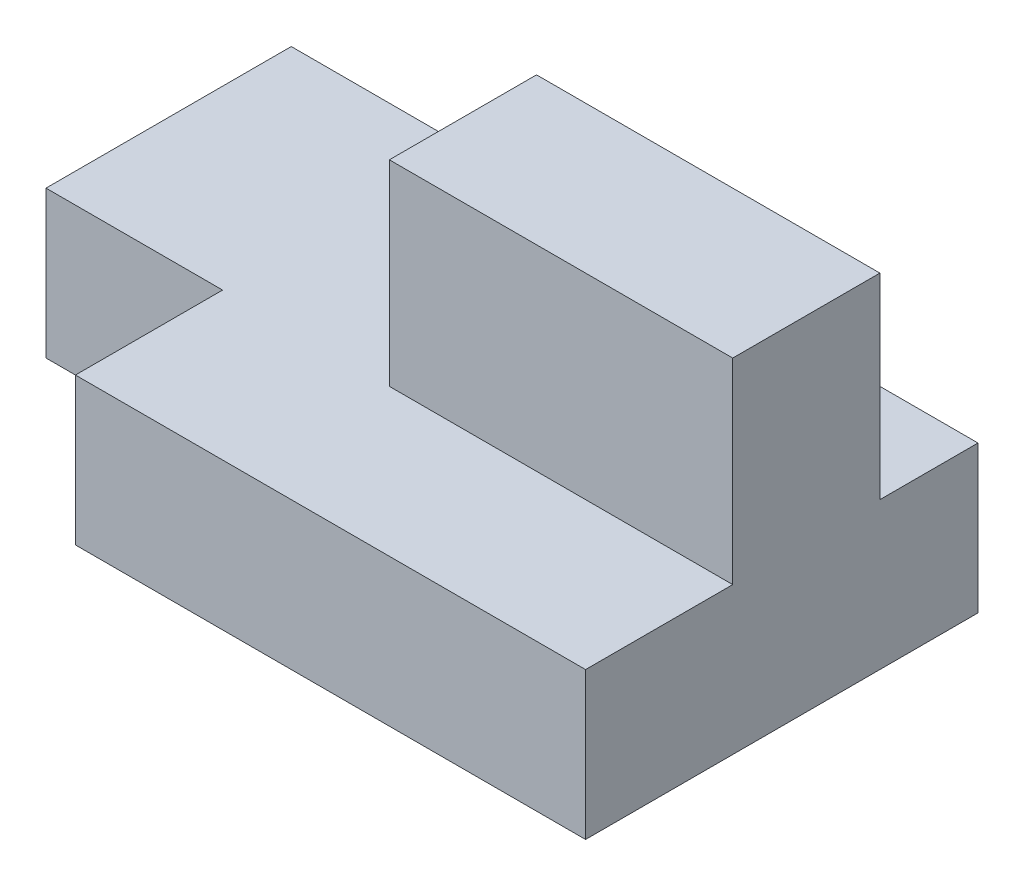
ISO-10303-21;
HEADER;
FILE_DESCRIPTION(('STEP AP214'),'2;1');
FILE_NAME('part.step','',(''),(''),'','','');
FILE_SCHEMA(('AUTOMOTIVE_DESIGN { 1 0 10303 214 1 1 1 1 }'));
ENDSEC;
DATA;
#1=APPLICATION_CONTEXT('core data for automotive mechanical design processes');
#2=APPLICATION_PROTOCOL_DEFINITION('international standard','automotive_design',2000,#1);
#3=PRODUCT_CONTEXT('',#1,'mechanical');
#4=PRODUCT('Part','Part','',(#3));
#5=PRODUCT_RELATED_PRODUCT_CATEGORY('part','',(#4));
#6=PRODUCT_DEFINITION_FORMATION('','',#4);
#7=PRODUCT_DEFINITION_CONTEXT('part definition',#1,'design');
#8=PRODUCT_DEFINITION('design','',#6,#7);
#9=PRODUCT_DEFINITION_SHAPE('','',#8);
#10=(LENGTH_UNIT() NAMED_UNIT(*) SI_UNIT(.MILLI.,.METRE.));
#11=(NAMED_UNIT(*) PLANE_ANGLE_UNIT() SI_UNIT($,.RADIAN.));
#12=(NAMED_UNIT(*) SI_UNIT($,.STERADIAN.) SOLID_ANGLE_UNIT());
#13=UNCERTAINTY_MEASURE_WITH_UNIT(LENGTH_MEASURE(1.E-05),#10,'distance_accuracy_value','');
#14=(GEOMETRIC_REPRESENTATION_CONTEXT(3) GLOBAL_UNCERTAINTY_ASSIGNED_CONTEXT((#13)) GLOBAL_UNIT_ASSIGNED_CONTEXT((#10,
#11,#12)) REPRESENTATION_CONTEXT('',''));
#15=CARTESIAN_POINT('',(0.,0.,0.));
#16=DIRECTION('',(0.,0.,1.));
#17=DIRECTION('',(1.,0.,0.));
#18=AXIS2_PLACEMENT_3D('',#15,#16,#17);
#19=CARTESIAN_POINT('',(0.,15.,0.));
#20=DIRECTION('',(0.,-1.,0.));
#21=DIRECTION('',(0.,0.,-1.));
#22=AXIS2_PLACEMENT_3D('',#19,#20,#21);
#23=PLANE('',#22);
#24=DIRECTION('',(1.,0.,0.));
#25=VECTOR('',#24,1.);
#26=CARTESIAN_POINT('',(0.,15.,25.));
#27=LINE('',#26,#25);
#28=CARTESIAN_POINT('',(-35.,15.,25.));
#29=VERTEX_POINT('',#28);
#30=CARTESIAN_POINT('',(0.,15.,25.));
#31=VERTEX_POINT('',#30);
#32=EDGE_CURVE('E48',#29,#31,#27,.T.);
#33=ORIENTED_EDGE('',*,*,#32,.F.);
#34=DIRECTION('',(0.,0.,1.));
#35=VECTOR('',#34,1.);
#36=CARTESIAN_POINT('',(-35.,15.,9.99999999999999));
#37=LINE('',#36,#35);
#38=CARTESIAN_POINT('',(-35.,15.,9.99999999999999));
#39=VERTEX_POINT('',#38);
#40=EDGE_CURVE('E206',#39,#29,#37,.T.);
#41=ORIENTED_EDGE('',*,*,#40,.F.);
#42=DIRECTION('',(-1.,0.,0.));
#43=VECTOR('',#42,1.);
#44=CARTESIAN_POINT('',(0.,15.,10.));
#45=LINE('',#44,#43);
#46=CARTESIAN_POINT('',(0.,15.,10.));
#47=VERTEX_POINT('',#46);
#48=EDGE_CURVE('E54',#47,#39,#45,.T.);
#49=ORIENTED_EDGE('',*,*,#48,.F.);
#50=DIRECTION('',(0.,0.,-1.));
#51=VECTOR('',#50,1.);
#52=CARTESIAN_POINT('',(0.,15.,0.));
#53=LINE('',#52,#51);
#54=CARTESIAN_POINT('',(0.,15.,0.));
#55=VERTEX_POINT('',#54);
#56=EDGE_CURVE('E131',#47,#55,#53,.T.);
#57=ORIENTED_EDGE('',*,*,#56,.T.);
#58=DIRECTION('',(-1.,0.,0.));
#59=VECTOR('',#58,1.);
#60=CARTESIAN_POINT('',(0.,15.,0.));
#61=LINE('',#60,#59);
#62=CARTESIAN_POINT('',(-70.,15.,0.));
#63=VERTEX_POINT('',#62);
#64=EDGE_CURVE('E142',#55,#63,#61,.T.);
#65=ORIENTED_EDGE('',*,*,#64,.T.);
#66=DIRECTION('',(0.,0.,1.));
#67=VECTOR('',#66,1.);
#68=CARTESIAN_POINT('',(-70.,15.,0.));
#69=LINE('',#68,#67);
#70=CARTESIAN_POINT('',(-70.,15.,25.));
#71=VERTEX_POINT('',#70);
#72=EDGE_CURVE('E144',#63,#71,#69,.T.);
#73=ORIENTED_EDGE('',*,*,#72,.T.);
#74=DIRECTION('',(1.,0.,0.));
#75=VECTOR('',#74,1.);
#76=CARTESIAN_POINT('',(-70.,15.,25.));
#77=LINE('',#76,#75);
#78=CARTESIAN_POINT('',(-52.,15.,25.));
#79=VERTEX_POINT('',#78);
#80=EDGE_CURVE('E146',#71,#79,#77,.T.);
#81=ORIENTED_EDGE('',*,*,#80,.T.);
#82=DIRECTION('',(0.,0.,1.));
#83=VECTOR('',#82,1.);
#84=CARTESIAN_POINT('',(-52.,15.,40.));
#85=LINE('',#84,#83);
#86=CARTESIAN_POINT('',(-52.,15.,40.));
#87=VERTEX_POINT('',#86);
#88=EDGE_CURVE('E148',#79,#87,#85,.T.);
#89=ORIENTED_EDGE('',*,*,#88,.T.);
#90=DIRECTION('',(1.,0.,0.));
#91=VECTOR('',#90,1.);
#92=CARTESIAN_POINT('',(0.,15.,40.));
#93=LINE('',#92,#91);
#94=CARTESIAN_POINT('',(0.,15.,40.));
#95=VERTEX_POINT('',#94);
#96=EDGE_CURVE('E150',#87,#95,#93,.T.);
#97=ORIENTED_EDGE('',*,*,#96,.T.);
#98=EDGE_CURVE('E140',#95,#31,#53,.T.);
#99=ORIENTED_EDGE('',*,*,#98,.T.);
#100=EDGE_LOOP('',(#33,#41,#49,#57,#65,#73,#81,#89,#97,#99));
#101=FACE_BOUND('',#100,.T.);
#102=ADVANCED_FACE('F33',(#101),#23,.F.);
#103=CARTESIAN_POINT('',(0.,15.,0.));
#104=DIRECTION('',(-1.,0.,0.));
#105=DIRECTION('',(0.,0.,1.));
#106=AXIS2_PLACEMENT_3D('',#103,#104,#105);
#107=PLANE('',#106);
#108=DIRECTION('',(0.,0.,-1.));
#109=VECTOR('',#108,1.);
#110=CARTESIAN_POINT('',(0.,0.,0.));
#111=LINE('',#110,#109);
#112=CARTESIAN_POINT('',(0.,0.,40.));
#113=VERTEX_POINT('',#112);
#114=CARTESIAN_POINT('',(0.,0.,0.));
#115=VERTEX_POINT('',#114);
#116=EDGE_CURVE('E132',#113,#115,#111,.T.);
#117=ORIENTED_EDGE('',*,*,#116,.T.);
#118=DIRECTION('',(0.,-1.,0.));
#119=VECTOR('',#118,1.);
#120=CARTESIAN_POINT('',(0.,15.,0.));
#121=LINE('',#120,#119);
#122=EDGE_CURVE('E11',#55,#115,#121,.T.);
#123=ORIENTED_EDGE('',*,*,#122,.F.);
#124=ORIENTED_EDGE('',*,*,#56,.F.);
#125=DIRECTION('',(0.,-1.,0.));
#126=VECTOR('',#125,1.);
#127=CARTESIAN_POINT('',(0.,35.,10.));
#128=LINE('',#127,#126);
#129=CARTESIAN_POINT('',(0.,35.,10.));
#130=VERTEX_POINT('',#129);
#131=EDGE_CURVE('E113',#130,#47,#128,.T.);
#132=ORIENTED_EDGE('',*,*,#131,.F.);
#133=DIRECTION('',(0.,0.,-1.));
#134=VECTOR('',#133,1.);
#135=CARTESIAN_POINT('',(0.,35.,10.));
#136=LINE('',#135,#134);
#137=CARTESIAN_POINT('',(0.,35.,25.));
#138=VERTEX_POINT('',#137);
#139=EDGE_CURVE('E119',#138,#130,#136,.T.);
#140=ORIENTED_EDGE('',*,*,#139,.F.);
#141=DIRECTION('',(0.,-1.,0.));
#142=VECTOR('',#141,1.);
#143=CARTESIAN_POINT('',(0.,35.,25.));
#144=LINE('',#143,#142);
#145=EDGE_CURVE('E201',#138,#31,#144,.T.);
#146=ORIENTED_EDGE('',*,*,#145,.T.);
#147=ORIENTED_EDGE('',*,*,#98,.F.);
#148=DIRECTION('',(0.,-1.,0.));
#149=VECTOR('',#148,1.);
#150=CARTESIAN_POINT('',(0.,15.,40.));
#151=LINE('',#150,#149);
#152=EDGE_CURVE('E151',#95,#113,#151,.T.);
#153=ORIENTED_EDGE('',*,*,#152,.T.);
#154=EDGE_LOOP('',(#117,#123,#124,#132,#140,#146,#147,#153));
#155=FACE_BOUND('',#154,.T.);
#156=ADVANCED_FACE('F35',(#155),#107,.F.);
#157=CARTESIAN_POINT('',(0.,15.,0.));
#158=DIRECTION('',(0.,0.,1.));
#159=DIRECTION('',(1.,0.,0.));
#160=AXIS2_PLACEMENT_3D('',#157,#158,#159);
#161=PLANE('',#160);
#162=DIRECTION('',(-1.,0.,0.));
#163=VECTOR('',#162,1.);
#164=CARTESIAN_POINT('',(0.,0.,0.));
#165=LINE('',#164,#163);
#166=CARTESIAN_POINT('',(-70.,0.,0.));
#167=VERTEX_POINT('',#166);
#168=EDGE_CURVE('E134',#115,#167,#165,.T.);
#169=ORIENTED_EDGE('',*,*,#168,.T.);
#170=DIRECTION('',(0.,-1.,0.));
#171=VECTOR('',#170,1.);
#172=CARTESIAN_POINT('',(-70.,15.,0.));
#173=LINE('',#172,#171);
#174=EDGE_CURVE('E41',#63,#167,#173,.T.);
#175=ORIENTED_EDGE('',*,*,#174,.F.);
#176=ORIENTED_EDGE('',*,*,#64,.F.);
#177=ORIENTED_EDGE('',*,*,#122,.T.);
#178=EDGE_LOOP('',(#169,#175,#176,#177));
#179=FACE_BOUND('',#178,.T.);
#180=ADVANCED_FACE('F197',(#179),#161,.F.);
#181=CARTESIAN_POINT('',(-70.,15.,0.));
#182=DIRECTION('',(1.,0.,0.));
#183=DIRECTION('',(0.,0.,-1.));
#184=AXIS2_PLACEMENT_3D('',#181,#182,#183);
#185=PLANE('',#184);
#186=DIRECTION('',(0.,0.,1.));
#187=VECTOR('',#186,1.);
#188=CARTESIAN_POINT('',(-70.,0.,0.));
#189=LINE('',#188,#187);
#190=CARTESIAN_POINT('',(-70.,0.,25.));
#191=VERTEX_POINT('',#190);
#192=EDGE_CURVE('E154',#167,#191,#189,.T.);
#193=ORIENTED_EDGE('',*,*,#192,.T.);
#194=DIRECTION('',(0.,-1.,0.));
#195=VECTOR('',#194,1.);
#196=CARTESIAN_POINT('',(-70.,15.,25.));
#197=LINE('',#196,#195);
#198=EDGE_CURVE('E170',#71,#191,#197,.T.);
#199=ORIENTED_EDGE('',*,*,#198,.F.);
#200=ORIENTED_EDGE('',*,*,#72,.F.);
#201=ORIENTED_EDGE('',*,*,#174,.T.);
#202=EDGE_LOOP('',(#193,#199,#200,#201));
#203=FACE_BOUND('',#202,.T.);
#204=ADVANCED_FACE('F177',(#203),#185,.F.);
#205=CARTESIAN_POINT('',(-70.,15.,25.));
#206=DIRECTION('',(0.,0.,-1.));
#207=DIRECTION('',(-1.,0.,0.));
#208=AXIS2_PLACEMENT_3D('',#205,#206,#207);
#209=PLANE('',#208);
#210=DIRECTION('',(1.,0.,0.));
#211=VECTOR('',#210,1.);
#212=CARTESIAN_POINT('',(-70.,0.,25.));
#213=LINE('',#212,#211);
#214=CARTESIAN_POINT('',(-52.,0.,25.));
#215=VERTEX_POINT('',#214);
#216=EDGE_CURVE('E156',#191,#215,#213,.T.);
#217=ORIENTED_EDGE('',*,*,#216,.T.);
#218=DIRECTION('',(0.,-1.,0.));
#219=VECTOR('',#218,1.);
#220=CARTESIAN_POINT('',(-52.,15.,25.));
#221=LINE('',#220,#219);
#222=EDGE_CURVE('E167',#79,#215,#221,.T.);
#223=ORIENTED_EDGE('',*,*,#222,.F.);
#224=ORIENTED_EDGE('',*,*,#80,.F.);
#225=ORIENTED_EDGE('',*,*,#198,.T.);
#226=EDGE_LOOP('',(#217,#223,#224,#225));
#227=FACE_BOUND('',#226,.T.);
#228=ADVANCED_FACE('F189',(#227),#209,.F.);
#229=CARTESIAN_POINT('',(-52.,15.,40.));
#230=DIRECTION('',(1.,0.,0.));
#231=DIRECTION('',(0.,0.,-1.));
#232=AXIS2_PLACEMENT_3D('',#229,#230,#231);
#233=PLANE('',#232);
#234=DIRECTION('',(0.,0.,1.));
#235=VECTOR('',#234,1.);
#236=CARTESIAN_POINT('',(-52.,0.,40.));
#237=LINE('',#236,#235);
#238=CARTESIAN_POINT('',(-52.,0.,40.));
#239=VERTEX_POINT('',#238);
#240=EDGE_CURVE('E158',#215,#239,#237,.T.);
#241=ORIENTED_EDGE('',*,*,#240,.T.);
#242=DIRECTION('',(0.,-1.,0.));
#243=VECTOR('',#242,1.);
#244=CARTESIAN_POINT('',(-52.,15.,40.));
#245=LINE('',#244,#243);
#246=EDGE_CURVE('E164',#87,#239,#245,.T.);
#247=ORIENTED_EDGE('',*,*,#246,.F.);
#248=ORIENTED_EDGE('',*,*,#88,.F.);
#249=ORIENTED_EDGE('',*,*,#222,.T.);
#250=EDGE_LOOP('',(#241,#247,#248,#249));
#251=FACE_BOUND('',#250,.T.);
#252=ADVANCED_FACE('F193',(#251),#233,.F.);
#253=CARTESIAN_POINT('',(0.,15.,40.));
#254=DIRECTION('',(0.,0.,-1.));
#255=DIRECTION('',(-1.,0.,0.));
#256=AXIS2_PLACEMENT_3D('',#253,#254,#255);
#257=PLANE('',#256);
#258=DIRECTION('',(1.,0.,0.));
#259=VECTOR('',#258,1.);
#260=CARTESIAN_POINT('',(0.,0.,40.));
#261=LINE('',#260,#259);
#262=EDGE_CURVE('E160',#239,#113,#261,.T.);
#263=ORIENTED_EDGE('',*,*,#262,.T.);
#264=ORIENTED_EDGE('',*,*,#152,.F.);
#265=ORIENTED_EDGE('',*,*,#96,.F.);
#266=ORIENTED_EDGE('',*,*,#246,.T.);
#267=EDGE_LOOP('',(#263,#264,#265,#266));
#268=FACE_BOUND('',#267,.T.);
#269=ADVANCED_FACE('F200',(#268),#257,.F.);
#270=CARTESIAN_POINT('',(0.,0.,0.));
#271=DIRECTION('',(0.,-1.,0.));
#272=DIRECTION('',(0.,0.,-1.));
#273=AXIS2_PLACEMENT_3D('',#270,#271,#272);
#274=PLANE('',#273);
#275=ORIENTED_EDGE('',*,*,#116,.F.);
#276=ORIENTED_EDGE('',*,*,#262,.F.);
#277=ORIENTED_EDGE('',*,*,#240,.F.);
#278=ORIENTED_EDGE('',*,*,#216,.F.);
#279=ORIENTED_EDGE('',*,*,#192,.F.);
#280=ORIENTED_EDGE('',*,*,#168,.F.);
#281=EDGE_LOOP('',(#275,#276,#277,#278,#279,#280));
#282=FACE_BOUND('',#281,.T.);
#283=ADVANCED_FACE('F184',(#282),#274,.T.);
#284=CARTESIAN_POINT('',(0.,35.,10.));
#285=DIRECTION('',(0.,0.,1.));
#286=DIRECTION('',(1.,0.,0.));
#287=AXIS2_PLACEMENT_3D('',#284,#285,#286);
#288=PLANE('',#287);
#289=ORIENTED_EDGE('',*,*,#48,.T.);
#290=DIRECTION('',(0.,-1.,0.));
#291=VECTOR('',#290,1.);
#292=CARTESIAN_POINT('',(-35.,35.,9.99999999999999));
#293=LINE('',#292,#291);
#294=CARTESIAN_POINT('',(-35.,35.,9.99999999999999));
#295=VERTEX_POINT('',#294);
#296=EDGE_CURVE('E115',#295,#39,#293,.T.);
#297=ORIENTED_EDGE('',*,*,#296,.F.);
#298=DIRECTION('',(-1.,0.,0.));
#299=VECTOR('',#298,1.);
#300=CARTESIAN_POINT('',(0.,35.,10.));
#301=LINE('',#300,#299);
#302=EDGE_CURVE('E109',#130,#295,#301,.T.);
#303=ORIENTED_EDGE('',*,*,#302,.F.);
#304=ORIENTED_EDGE('',*,*,#131,.T.);
#305=EDGE_LOOP('',(#289,#297,#303,#304));
#306=FACE_BOUND('',#305,.T.);
#307=ADVANCED_FACE('F111',(#306),#288,.F.);
#308=CARTESIAN_POINT('',(-35.,35.,9.99999999999999));
#309=DIRECTION('',(1.,0.,0.));
#310=DIRECTION('',(0.,0.,-1.));
#311=AXIS2_PLACEMENT_3D('',#308,#309,#310);
#312=PLANE('',#311);
#313=ORIENTED_EDGE('',*,*,#40,.T.);
#314=DIRECTION('',(0.,-1.,0.));
#315=VECTOR('',#314,1.);
#316=CARTESIAN_POINT('',(-35.,35.,25.));
#317=LINE('',#316,#315);
#318=CARTESIAN_POINT('',(-35.,35.,25.));
#319=VERTEX_POINT('',#318);
#320=EDGE_CURVE('E136',#319,#29,#317,.T.);
#321=ORIENTED_EDGE('',*,*,#320,.F.);
#322=DIRECTION('',(0.,0.,1.));
#323=VECTOR('',#322,1.);
#324=CARTESIAN_POINT('',(-35.,35.,9.99999999999999));
#325=LINE('',#324,#323);
#326=EDGE_CURVE('E118',#295,#319,#325,.T.);
#327=ORIENTED_EDGE('',*,*,#326,.F.);
#328=ORIENTED_EDGE('',*,*,#296,.T.);
#329=EDGE_LOOP('',(#313,#321,#327,#328));
#330=FACE_BOUND('',#329,.T.);
#331=ADVANCED_FACE('F214',(#330),#312,.F.);
#332=CARTESIAN_POINT('',(0.,35.,25.));
#333=DIRECTION('',(0.,0.,-1.));
#334=DIRECTION('',(-1.,0.,0.));
#335=AXIS2_PLACEMENT_3D('',#332,#333,#334);
#336=PLANE('',#335);
#337=ORIENTED_EDGE('',*,*,#32,.T.);
#338=ORIENTED_EDGE('',*,*,#145,.F.);
#339=DIRECTION('',(1.,0.,0.));
#340=VECTOR('',#339,1.);
#341=CARTESIAN_POINT('',(0.,35.,25.));
#342=LINE('',#341,#340);
#343=EDGE_CURVE('E124',#319,#138,#342,.T.);
#344=ORIENTED_EDGE('',*,*,#343,.F.);
#345=ORIENTED_EDGE('',*,*,#320,.T.);
#346=EDGE_LOOP('',(#337,#338,#344,#345));
#347=FACE_BOUND('',#346,.T.);
#348=ADVANCED_FACE('F204',(#347),#336,.F.);
#349=CARTESIAN_POINT('',(0.,35.,0.));
#350=DIRECTION('',(0.,-1.,0.));
#351=DIRECTION('',(0.,0.,-1.));
#352=AXIS2_PLACEMENT_3D('',#349,#350,#351);
#353=PLANE('',#352);
#354=ORIENTED_EDGE('',*,*,#139,.T.);
#355=ORIENTED_EDGE('',*,*,#302,.T.);
#356=ORIENTED_EDGE('',*,*,#326,.T.);
#357=ORIENTED_EDGE('',*,*,#343,.T.);
#358=EDGE_LOOP('',(#354,#355,#356,#357));
#359=FACE_BOUND('',#358,.T.);
#360=ADVANCED_FACE('F122',(#359),#353,.F.);
#361=CLOSED_SHELL('',(#102,#156,#180,#204,#228,#252,#269,#283,#307,#331,#348,#360));
#362=MANIFOLD_SOLID_BREP('B2',#361);
#363=ADVANCED_BREP_SHAPE_REPRESENTATION('',(#18,#362),#14);
#364=SHAPE_DEFINITION_REPRESENTATION(#9,#363);
ENDSEC;
END-ISO-10303-21;
